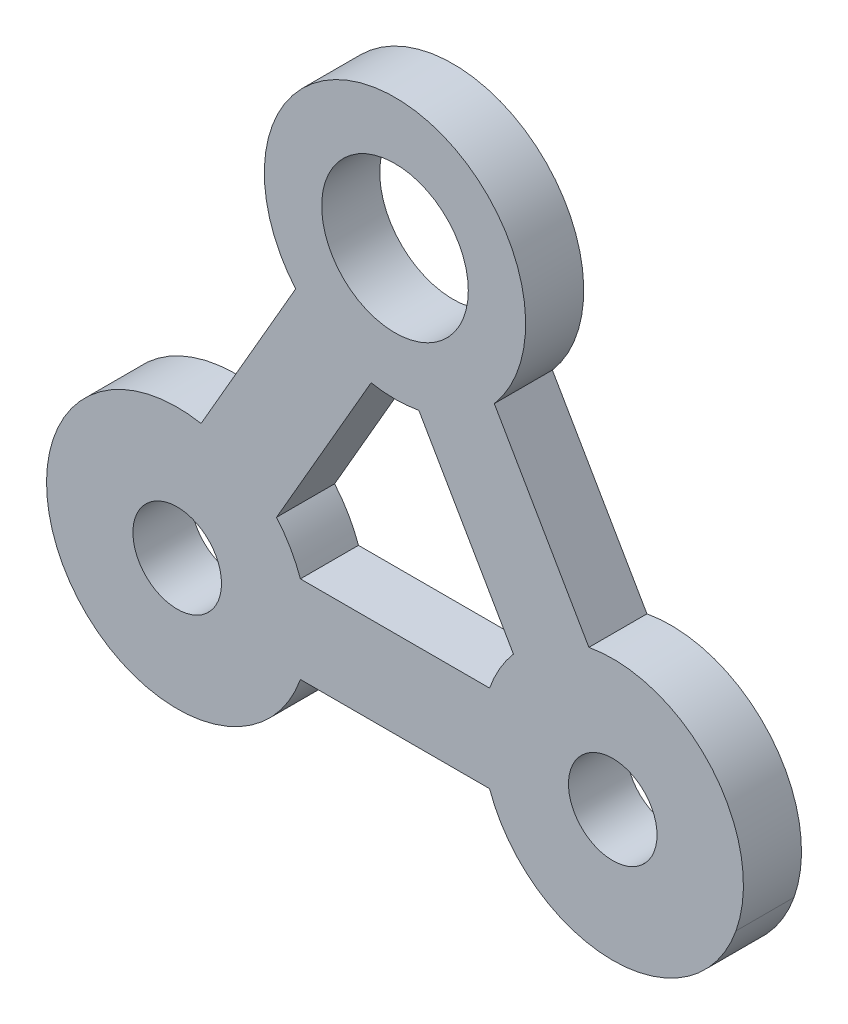
ISO-10303-21;
HEADER;
FILE_DESCRIPTION(('STEP AP214'),'2;1');
FILE_NAME('part.step','',(''),(''),'','','');
FILE_SCHEMA(('AUTOMOTIVE_DESIGN { 1 0 10303 214 1 1 1 1 }'));
ENDSEC;
DATA;
#1=APPLICATION_CONTEXT('core data for automotive mechanical design processes');
#2=APPLICATION_PROTOCOL_DEFINITION('international standard','automotive_design',2000,#1);
#3=PRODUCT_CONTEXT('',#1,'mechanical');
#4=PRODUCT('Part','Part','',(#3));
#5=PRODUCT_RELATED_PRODUCT_CATEGORY('part','',(#4));
#6=PRODUCT_DEFINITION_FORMATION('','',#4);
#7=PRODUCT_DEFINITION_CONTEXT('part definition',#1,'design');
#8=PRODUCT_DEFINITION('design','',#6,#7);
#9=PRODUCT_DEFINITION_SHAPE('','',#8);
#10=(LENGTH_UNIT() NAMED_UNIT(*) SI_UNIT(.MILLI.,.METRE.));
#11=(NAMED_UNIT(*) PLANE_ANGLE_UNIT() SI_UNIT($,.RADIAN.));
#12=(NAMED_UNIT(*) SI_UNIT($,.STERADIAN.) SOLID_ANGLE_UNIT());
#13=UNCERTAINTY_MEASURE_WITH_UNIT(LENGTH_MEASURE(1.E-05),#10,'distance_accuracy_value','');
#14=(GEOMETRIC_REPRESENTATION_CONTEXT(3) GLOBAL_UNCERTAINTY_ASSIGNED_CONTEXT((#13)) GLOBAL_UNIT_ASSIGNED_CONTEXT((#10,
#11,#12)) REPRESENTATION_CONTEXT('',''));
#15=CARTESIAN_POINT('',(0.,0.,0.));
#16=DIRECTION('',(0.,0.,1.));
#17=DIRECTION('',(1.,0.,0.));
#18=AXIS2_PLACEMENT_3D('',#15,#16,#17);
#19=CARTESIAN_POINT('',(10.0690039999383,-30.7922345044947,4.));
#20=DIRECTION('',(0.,0.,1.));
#21=DIRECTION('',(1.,0.,0.));
#22=AXIS2_PLACEMENT_3D('',#19,#20,#21);
#23=PLANE('',#22);
#24=CARTESIAN_POINT('',(-4.93094233155493,-4.81141433276065,4.));
#25=DIRECTION('',(0.,0.,1.));
#26=DIRECTION('',(1.,0.,0.));
#27=AXIS2_PLACEMENT_3D('',#24,#25,#26);
#28=CIRCLE('',#27,5.05);
#29=CARTESIAN_POINT('',(0.119057668445069,-4.81141433276065,4.));
#30=VERTEX_POINT('',#29);
#31=EDGE_CURVE('E582',#30,#30,#28,.T.);
#32=ORIENTED_EDGE('',*,*,#31,.F.);
#33=EDGE_LOOP('',(#32));
#34=FACE_BOUND('',#33,.T.);
#35=DIRECTION('',(-0.500000694027765,-0.866025003086951,0.));
#36=VECTOR('',#35,1.);
#37=CARTESIAN_POINT('',(-13.0902623878487,-24.9437367418577,4.));
#38=LINE('',#37,#36);
#39=CARTESIAN_POINT('',(-6.57551389843423,-13.6598822431626,4.));
#40=VERTEX_POINT('',#39);
#41=CARTESIAN_POINT('',(-13.0902623878487,-24.9437367418577,4.));
#42=VERTEX_POINT('',#41);
#43=EDGE_CURVE('E172',#40,#42,#38,.T.);
#44=ORIENTED_EDGE('',*,*,#43,.F.);
#45=CARTESIAN_POINT('',(-4.93094233155493,-4.81141433276065,4.));
#46=DIRECTION('',(0.,0.,-1.));
#47=DIRECTION('',(1.,0.,0.));
#48=AXIS2_PLACEMENT_3D('',#45,#46,#47);
#49=CIRCLE('',#48,9.);
#50=CARTESIAN_POINT('',(-3.28643861537157,-13.6598948535879,4.));
#51=VERTEX_POINT('',#50);
#52=EDGE_CURVE('E164',#51,#40,#49,.T.);
#53=ORIENTED_EDGE('',*,*,#52,.F.);
#54=DIRECTION('',(-0.499999305971914,0.86602580448137,0.));
#55=VECTOR('',#54,1.);
#56=CARTESIAN_POINT('',(-3.28643861537157,-13.6598948535879,4.));
#57=LINE('',#56,#55);
#58=CARTESIAN_POINT('',(3.2282917883985,-24.9437597940347,4.));
#59=VERTEX_POINT('',#58);
#60=EDGE_CURVE('E195',#59,#51,#57,.T.);
#61=ORIENTED_EDGE('',*,*,#60,.F.);
#62=CARTESIAN_POINT('',(10.0690039999383,-30.7922345044947,4.));
#63=DIRECTION('',(0.,0.,-1.));
#64=DIRECTION('',(1.,0.,0.));
#65=AXIS2_PLACEMENT_3D('',#62,#63,#64);
#66=CIRCLE('',#65,9.);
#67=CARTESIAN_POINT('',(1.58374322591848,-27.7921762389138,4.));
#68=VERTEX_POINT('',#67);
#69=EDGE_CURVE('E193',#68,#59,#66,.T.);
#70=ORIENTED_EDGE('',*,*,#69,.F.);
#71=DIRECTION('',(0.999999999999679,-8.01394419053135E-07,0.));
#72=VECTOR('',#71,1.);
#73=CARTESIAN_POINT('',(1.58374322591848,-27.7921762389138,4.));
#74=LINE('',#73,#72);
#75=CARTESIAN_POINT('',(-11.4457356672661,-27.7921657971621,4.));
#76=VERTEX_POINT('',#75);
#77=EDGE_CURVE('E188',#76,#68,#74,.T.);
#78=ORIENTED_EDGE('',*,*,#77,.F.);
#79=CARTESIAN_POINT('',(-19.9310194456852,-30.792158997104,4.));
#80=DIRECTION('',(0.,0.,-1.));
#81=DIRECTION('',(1.,0.,0.));
#82=AXIS2_PLACEMENT_3D('',#79,#80,#81);
#83=CIRCLE('',#82,9.00000000000001);
#84=EDGE_CURVE('E186',#42,#76,#83,.T.);
#85=ORIENTED_EDGE('',*,*,#84,.F.);
#86=EDGE_LOOP('',(#44,#53,#61,#70,#78,#85));
#87=FACE_BOUND('',#86,.T.);
#88=CARTESIAN_POINT('',(10.0690039999383,-30.7922345044947,4.));
#89=DIRECTION('',(0.,0.,1.));
#90=DIRECTION('',(1.,0.,0.));
#91=AXIS2_PLACEMENT_3D('',#88,#89,#90);
#92=CIRCLE('',#91,9.00000000000001);
#93=CARTESIAN_POINT('',(18.5542758795681,-33.7922613591684,4.));
#94=VERTEX_POINT('',#93);
#95=CARTESIAN_POINT('',(8.42444661528672,-21.9437639582032,4.));
#96=VERTEX_POINT('',#95);
#97=EDGE_CURVE('E220',#94,#96,#92,.T.);
#98=ORIENTED_EDGE('',*,*,#97,.T.);
#99=DIRECTION('',(-0.499999305971914,0.86602580448137,0.));
#100=VECTOR('',#99,1.);
#101=CARTESIAN_POINT('',(8.42444661528672,-21.9437639582032,4.));
#102=LINE('',#101,#100);
#103=CARTESIAN_POINT('',(1.90973440730732,-10.6599305338487,4.));
#104=VERTEX_POINT('',#103);
#105=EDGE_CURVE('E224',#96,#104,#102,.T.);
#106=ORIENTED_EDGE('',*,*,#105,.T.);
#107=CARTESIAN_POINT('',(-4.93094233155493,-4.81141433276065,4.));
#108=DIRECTION('',(0.,0.,1.));
#109=DIRECTION('',(1.,0.,0.));
#110=AXIS2_PLACEMENT_3D('',#107,#108,#109);
#111=CIRCLE('',#110,9.);
#112=CARTESIAN_POINT('',(-11.7716639169559,-10.659878078996,4.));
#113=VERTEX_POINT('',#112);
#114=EDGE_CURVE('E228',#104,#113,#111,.T.);
#115=ORIENTED_EDGE('',*,*,#114,.T.);
#116=DIRECTION('',(-0.500000694027764,-0.866025003086951,0.));
#117=VECTOR('',#116,1.);
#118=CARTESIAN_POINT('',(-11.7716639169559,-10.659878078996,4.));
#119=LINE('',#118,#117);
#120=CARTESIAN_POINT('',(-18.2863942105292,-21.943701061628,4.));
#121=VERTEX_POINT('',#120);
#122=EDGE_CURVE('E231',#113,#121,#119,.T.);
#123=ORIENTED_EDGE('',*,*,#122,.T.);
#124=CARTESIAN_POINT('',(-19.9310194456852,-30.792158997104,4.));
#125=DIRECTION('',(0.,0.,1.));
#126=DIRECTION('',(1.,0.,0.));
#127=AXIS2_PLACEMENT_3D('',#124,#125,#126);
#128=CIRCLE('',#127,9.00000000000001);
#129=CARTESIAN_POINT('',(-27.7099816604268,-26.2658197630627,4.));
#130=VERTEX_POINT('',#129);
#131=EDGE_CURVE('E234',#121,#130,#128,.T.);
#132=ORIENTED_EDGE('',*,*,#131,.T.);
#133=DIRECTION('',(-0.500000694027499,-0.866025003087104,0.));
#134=VECTOR('',#133,1.);
#135=CARTESIAN_POINT('',(-27.7099816604268,-26.2658197630627,4.));
#136=LINE('',#135,#134);
#137=CARTESIAN_POINT('',(-27.7252090010324,-26.2921942418434,4.));
#138=VERTEX_POINT('',#137);
#139=EDGE_CURVE('E236',#130,#138,#136,.T.);
#140=ORIENTED_EDGE('',*,*,#139,.T.);
#141=CARTESIAN_POINT('',(-19.9309839732497,-30.792200488093,4.));
#142=DIRECTION('',(0.,0.,1.));
#143=DIRECTION('',(1.,0.,0.));
#144=AXIS2_PLACEMENT_3D('',#141,#142,#143);
#145=CIRCLE('',#144,9.);
#146=CARTESIAN_POINT('',(-26.7717410302534,-36.6406227443135,4.));
#147=VERTEX_POINT('',#146);
#148=EDGE_CURVE('E238',#138,#147,#145,.T.);
#149=ORIENTED_EDGE('',*,*,#148,.T.);
#150=CARTESIAN_POINT('',(-19.9310194456852,-30.792158997104,4.));
#151=DIRECTION('',(0.,0.,1.));
#152=DIRECTION('',(1.,0.,0.));
#153=AXIS2_PLACEMENT_3D('',#150,#151,#152);
#154=CIRCLE('',#153,9.00000000000001);
#155=CARTESIAN_POINT('',(-11.4457404756326,-33.7921657971602,4.));
#156=VERTEX_POINT('',#155);
#157=EDGE_CURVE('E241',#147,#156,#154,.T.);
#158=ORIENTED_EDGE('',*,*,#157,.T.);
#159=DIRECTION('',(0.999999999999679,-8.01394418245061E-07,0.));
#160=VECTOR('',#159,1.);
#161=CARTESIAN_POINT('',(-11.4457404756326,-33.7921657971602,4.));
#162=LINE('',#161,#160);
#163=CARTESIAN_POINT('',(1.58370202592011,-33.7921762388827,4.));
#164=VERTEX_POINT('',#163);
#165=EDGE_CURVE('E243',#156,#164,#162,.T.);
#166=ORIENTED_EDGE('',*,*,#165,.T.);
#167=CARTESIAN_POINT('',(10.0690039999383,-30.7922345044947,4.));
#168=DIRECTION('',(0.,0.,1.));
#169=DIRECTION('',(1.,0.,0.));
#170=AXIS2_PLACEMENT_3D('',#167,#168,#169);
#171=CIRCLE('',#170,9.00000000000001);
#172=CARTESIAN_POINT('',(10.0442594232947,-39.792200488093,4.));
#173=VERTEX_POINT('',#172);
#174=EDGE_CURVE('E245',#164,#173,#171,.T.);
#175=ORIENTED_EDGE('',*,*,#174,.T.);
#176=DIRECTION('',(1.,2.80284567968024E-13,0.));
#177=VECTOR('',#176,1.);
#178=CARTESIAN_POINT('',(10.0442594232947,-39.792200488093,4.));
#179=LINE('',#178,#177);
#180=CARTESIAN_POINT('',(10.0690160267503,-39.792200488093,4.));
#181=VERTEX_POINT('',#180);
#182=EDGE_CURVE('E247',#173,#181,#179,.T.);
#183=ORIENTED_EDGE('',*,*,#182,.T.);
#184=CARTESIAN_POINT('',(10.0690160267503,-30.792200488093,4.));
#185=DIRECTION('',(0.,0.,1.));
#186=DIRECTION('',(1.,0.,0.));
#187=AXIS2_PLACEMENT_3D('',#184,#185,#186);
#188=CIRCLE('',#187,9.00000000000001);
#189=EDGE_CURVE('E249',#181,#94,#188,.T.);
#190=ORIENTED_EDGE('',*,*,#189,.T.);
#191=EDGE_LOOP('',(#98,#106,#115,#123,#132,#140,#149,#158,#166,#175,#183,#190));
#192=FACE_BOUND('',#191,.T.);
#193=CARTESIAN_POINT('',(10.0690160267503,-30.792200488093,4.));
#194=DIRECTION('',(0.,0.,1.));
#195=DIRECTION('',(1.,0.,0.));
#196=AXIS2_PLACEMENT_3D('',#193,#194,#195);
#197=CIRCLE('',#196,3.05);
#198=CARTESIAN_POINT('',(13.1190160267503,-30.792200488093,4.));
#199=VERTEX_POINT('',#198);
#200=EDGE_CURVE('E199',#199,#199,#197,.T.);
#201=ORIENTED_EDGE('',*,*,#200,.F.);
#202=EDGE_LOOP('',(#201));
#203=FACE_BOUND('',#202,.T.);
#204=CARTESIAN_POINT('',(-19.9309839732497,-30.792200488093,4.));
#205=DIRECTION('',(0.,0.,1.));
#206=DIRECTION('',(1.,0.,0.));
#207=AXIS2_PLACEMENT_3D('',#204,#205,#206);
#208=CIRCLE('',#207,3.05);
#209=CARTESIAN_POINT('',(-16.8809839732497,-30.792200488093,4.));
#210=VERTEX_POINT('',#209);
#211=EDGE_CURVE('E596',#210,#210,#208,.T.);
#212=ORIENTED_EDGE('',*,*,#211,.F.);
#213=EDGE_LOOP('',(#212));
#214=FACE_BOUND('',#213,.T.);
#215=ADVANCED_FACE('F39',(#34,#87,#192,#203,#214),#23,.T.);
#216=CARTESIAN_POINT('',(10.0690039999383,-30.7922345044947,0.));
#217=DIRECTION('',(0.,0.,1.));
#218=DIRECTION('',(1.,0.,0.));
#219=AXIS2_PLACEMENT_3D('',#216,#217,#218);
#220=PLANE('',#219);
#221=CARTESIAN_POINT('',(10.0690039999383,-30.7922345044947,0.));
#222=DIRECTION('',(0.,0.,1.));
#223=DIRECTION('',(1.,0.,0.));
#224=AXIS2_PLACEMENT_3D('',#221,#222,#223);
#225=CIRCLE('',#224,9.00000000000001);
#226=CARTESIAN_POINT('',(18.5542758795681,-33.7922613591684,0.));
#227=VERTEX_POINT('',#226);
#228=CARTESIAN_POINT('',(8.42444661528672,-21.9437639582032,0.));
#229=VERTEX_POINT('',#228);
#230=EDGE_CURVE('E180',#227,#229,#225,.T.);
#231=ORIENTED_EDGE('',*,*,#230,.F.);
#232=CARTESIAN_POINT('',(10.0690160267503,-30.792200488093,0.));
#233=DIRECTION('',(0.,0.,1.));
#234=DIRECTION('',(1.,0.,0.));
#235=AXIS2_PLACEMENT_3D('',#232,#233,#234);
#236=CIRCLE('',#235,9.00000000000001);
#237=CARTESIAN_POINT('',(10.0690160267503,-39.792200488093,0.));
#238=VERTEX_POINT('',#237);
#239=EDGE_CURVE('E225',#238,#227,#236,.T.);
#240=ORIENTED_EDGE('',*,*,#239,.F.);
#241=DIRECTION('',(1.,2.80284567968024E-13,0.));
#242=VECTOR('',#241,1.);
#243=CARTESIAN_POINT('',(10.0442594232947,-39.792200488093,0.));
#244=LINE('',#243,#242);
#245=CARTESIAN_POINT('',(10.0442594232947,-39.792200488093,0.));
#246=VERTEX_POINT('',#245);
#247=EDGE_CURVE('E278',#246,#238,#244,.T.);
#248=ORIENTED_EDGE('',*,*,#247,.F.);
#249=CARTESIAN_POINT('',(10.0690039999383,-30.7922345044947,0.));
#250=DIRECTION('',(0.,0.,1.));
#251=DIRECTION('',(1.,0.,0.));
#252=AXIS2_PLACEMENT_3D('',#249,#250,#251);
#253=CIRCLE('',#252,9.00000000000001);
#254=CARTESIAN_POINT('',(1.58370202592011,-33.7921762388827,0.));
#255=VERTEX_POINT('',#254);
#256=EDGE_CURVE('E276',#255,#246,#253,.T.);
#257=ORIENTED_EDGE('',*,*,#256,.F.);
#258=DIRECTION('',(0.999999999999679,-8.01394418245061E-07,0.));
#259=VECTOR('',#258,1.);
#260=CARTESIAN_POINT('',(-11.4457404756326,-33.7921657971602,0.));
#261=LINE('',#260,#259);
#262=CARTESIAN_POINT('',(-11.4457404756326,-33.7921657971602,0.));
#263=VERTEX_POINT('',#262);
#264=EDGE_CURVE('E273',#263,#255,#261,.T.);
#265=ORIENTED_EDGE('',*,*,#264,.F.);
#266=CARTESIAN_POINT('',(-19.9310194456852,-30.792158997104,0.));
#267=DIRECTION('',(0.,0.,1.));
#268=DIRECTION('',(1.,0.,0.));
#269=AXIS2_PLACEMENT_3D('',#266,#267,#268);
#270=CIRCLE('',#269,9.00000000000001);
#271=CARTESIAN_POINT('',(-26.7717410302534,-36.6406227443135,0.));
#272=VERTEX_POINT('',#271);
#273=EDGE_CURVE('E270',#272,#263,#270,.T.);
#274=ORIENTED_EDGE('',*,*,#273,.F.);
#275=CARTESIAN_POINT('',(-19.9309839732497,-30.792200488093,0.));
#276=DIRECTION('',(0.,0.,1.));
#277=DIRECTION('',(1.,0.,0.));
#278=AXIS2_PLACEMENT_3D('',#275,#276,#277);
#279=CIRCLE('',#278,9.);
#280=CARTESIAN_POINT('',(-27.7252090010324,-26.2921942418434,0.));
#281=VERTEX_POINT('',#280);
#282=EDGE_CURVE('E267',#281,#272,#279,.T.);
#283=ORIENTED_EDGE('',*,*,#282,.F.);
#284=DIRECTION('',(-0.500000694027499,-0.866025003087104,0.));
#285=VECTOR('',#284,1.);
#286=CARTESIAN_POINT('',(-27.7099816604268,-26.2658197630627,0.));
#287=LINE('',#286,#285);
#288=CARTESIAN_POINT('',(-27.7099816604268,-26.2658197630627,0.));
#289=VERTEX_POINT('',#288);
#290=EDGE_CURVE('E265',#289,#281,#287,.T.);
#291=ORIENTED_EDGE('',*,*,#290,.F.);
#292=CARTESIAN_POINT('',(-19.9310194456852,-30.792158997104,0.));
#293=DIRECTION('',(0.,0.,1.));
#294=DIRECTION('',(1.,0.,0.));
#295=AXIS2_PLACEMENT_3D('',#292,#293,#294);
#296=CIRCLE('',#295,9.00000000000001);
#297=CARTESIAN_POINT('',(-18.2863942105292,-21.943701061628,0.));
#298=VERTEX_POINT('',#297);
#299=EDGE_CURVE('E262',#298,#289,#296,.T.);
#300=ORIENTED_EDGE('',*,*,#299,.F.);
#301=DIRECTION('',(-0.500000694027764,-0.866025003086951,0.));
#302=VECTOR('',#301,1.);
#303=CARTESIAN_POINT('',(-11.7716639169559,-10.659878078996,0.));
#304=LINE('',#303,#302);
#305=CARTESIAN_POINT('',(-11.7716639169559,-10.659878078996,0.));
#306=VERTEX_POINT('',#305);
#307=EDGE_CURVE('E260',#306,#298,#304,.T.);
#308=ORIENTED_EDGE('',*,*,#307,.F.);
#309=CARTESIAN_POINT('',(-4.93094233155493,-4.81141433276065,0.));
#310=DIRECTION('',(0.,0.,1.));
#311=DIRECTION('',(1.,0.,0.));
#312=AXIS2_PLACEMENT_3D('',#309,#310,#311);
#313=CIRCLE('',#312,9.);
#314=CARTESIAN_POINT('',(1.90973440730732,-10.6599305338487,0.));
#315=VERTEX_POINT('',#314);
#316=EDGE_CURVE('E258',#315,#306,#313,.T.);
#317=ORIENTED_EDGE('',*,*,#316,.F.);
#318=DIRECTION('',(-0.499999305971914,0.86602580448137,0.));
#319=VECTOR('',#318,1.);
#320=CARTESIAN_POINT('',(8.42444661528672,-21.9437639582032,0.));
#321=LINE('',#320,#319);
#322=EDGE_CURVE('E255',#229,#315,#321,.T.);
#323=ORIENTED_EDGE('',*,*,#322,.F.);
#324=EDGE_LOOP('',(#231,#240,#248,#257,#265,#274,#283,#291,#300,#308,#317,#323));
#325=FACE_BOUND('',#324,.T.);
#326=CARTESIAN_POINT('',(-4.93094233155493,-4.81141433276065,0.));
#327=DIRECTION('',(0.,0.,-1.));
#328=DIRECTION('',(1.,0.,0.));
#329=AXIS2_PLACEMENT_3D('',#326,#327,#328);
#330=CIRCLE('',#329,9.);
#331=CARTESIAN_POINT('',(-3.28643861537157,-13.6598948535879,0.));
#332=VERTEX_POINT('',#331);
#333=CARTESIAN_POINT('',(-6.57551389843423,-13.6598822431626,0.));
#334=VERTEX_POINT('',#333);
#335=EDGE_CURVE('E62',#332,#334,#330,.T.);
#336=ORIENTED_EDGE('',*,*,#335,.T.);
#337=DIRECTION('',(-0.500000694027765,-0.866025003086951,0.));
#338=VECTOR('',#337,1.);
#339=CARTESIAN_POINT('',(-13.0902623878487,-24.9437367418577,0.));
#340=LINE('',#339,#338);
#341=CARTESIAN_POINT('',(-13.0902623878487,-24.9437367418577,0.));
#342=VERTEX_POINT('',#341);
#343=EDGE_CURVE('E179',#334,#342,#340,.T.);
#344=ORIENTED_EDGE('',*,*,#343,.T.);
#345=CARTESIAN_POINT('',(-19.9310194456852,-30.792158997104,0.));
#346=DIRECTION('',(0.,0.,-1.));
#347=DIRECTION('',(1.,0.,0.));
#348=AXIS2_PLACEMENT_3D('',#345,#346,#347);
#349=CIRCLE('',#348,9.00000000000001);
#350=CARTESIAN_POINT('',(-11.4457356672661,-27.7921657971621,0.));
#351=VERTEX_POINT('',#350);
#352=EDGE_CURVE('E201',#342,#351,#349,.T.);
#353=ORIENTED_EDGE('',*,*,#352,.T.);
#354=DIRECTION('',(0.999999999999679,-8.01394419053135E-07,0.));
#355=VECTOR('',#354,1.);
#356=CARTESIAN_POINT('',(1.58374322591848,-27.7921762389138,0.));
#357=LINE('',#356,#355);
#358=CARTESIAN_POINT('',(1.58374322591848,-27.7921762389138,0.));
#359=VERTEX_POINT('',#358);
#360=EDGE_CURVE('E204',#351,#359,#357,.T.);
#361=ORIENTED_EDGE('',*,*,#360,.T.);
#362=CARTESIAN_POINT('',(10.0690039999383,-30.7922345044947,0.));
#363=DIRECTION('',(0.,0.,-1.));
#364=DIRECTION('',(1.,0.,0.));
#365=AXIS2_PLACEMENT_3D('',#362,#363,#364);
#366=CIRCLE('',#365,9.);
#367=CARTESIAN_POINT('',(3.2282917883985,-24.9437597940347,0.));
#368=VERTEX_POINT('',#367);
#369=EDGE_CURVE('E207',#359,#368,#366,.T.);
#370=ORIENTED_EDGE('',*,*,#369,.T.);
#371=DIRECTION('',(-0.499999305971914,0.86602580448137,0.));
#372=VECTOR('',#371,1.);
#373=CARTESIAN_POINT('',(-3.28643861537157,-13.6598948535879,0.));
#374=LINE('',#373,#372);
#375=EDGE_CURVE('E173',#368,#332,#374,.T.);
#376=ORIENTED_EDGE('',*,*,#375,.T.);
#377=EDGE_LOOP('',(#336,#344,#353,#361,#370,#376));
#378=FACE_BOUND('',#377,.T.);
#379=CARTESIAN_POINT('',(10.0690160267503,-30.792200488093,0.));
#380=DIRECTION('',(0.,0.,1.));
#381=DIRECTION('',(1.,0.,0.));
#382=AXIS2_PLACEMENT_3D('',#379,#380,#381);
#383=CIRCLE('',#382,3.05);
#384=CARTESIAN_POINT('',(13.1190160267503,-30.792200488093,0.));
#385=VERTEX_POINT('',#384);
#386=EDGE_CURVE('E579',#385,#385,#383,.T.);
#387=ORIENTED_EDGE('',*,*,#386,.T.);
#388=EDGE_LOOP('',(#387));
#389=FACE_BOUND('',#388,.T.);
#390=CARTESIAN_POINT('',(-4.93094233155493,-4.81141433276065,0.));
#391=DIRECTION('',(0.,0.,1.));
#392=DIRECTION('',(1.,0.,0.));
#393=AXIS2_PLACEMENT_3D('',#390,#391,#392);
#394=CIRCLE('',#393,5.05);
#395=CARTESIAN_POINT('',(0.119057668445069,-4.81141433276065,0.));
#396=VERTEX_POINT('',#395);
#397=EDGE_CURVE('E592',#396,#396,#394,.T.);
#398=ORIENTED_EDGE('',*,*,#397,.T.);
#399=EDGE_LOOP('',(#398));
#400=FACE_BOUND('',#399,.T.);
#401=CARTESIAN_POINT('',(-19.9309839732497,-30.792200488093,0.));
#402=DIRECTION('',(0.,0.,1.));
#403=DIRECTION('',(1.,0.,0.));
#404=AXIS2_PLACEMENT_3D('',#401,#402,#403);
#405=CIRCLE('',#404,3.05);
#406=CARTESIAN_POINT('',(-16.8809839732497,-30.792200488093,0.));
#407=VERTEX_POINT('',#406);
#408=EDGE_CURVE('E598',#407,#407,#405,.T.);
#409=ORIENTED_EDGE('',*,*,#408,.T.);
#410=EDGE_LOOP('',(#409));
#411=FACE_BOUND('',#410,.T.);
#412=ADVANCED_FACE('F322',(#325,#378,#389,#400,#411),#220,.F.);
#413=CARTESIAN_POINT('',(10.0690039999383,-30.7922345044947,4.));
#414=DIRECTION('',(0.,0.,-1.));
#415=DIRECTION('',(-1.,0.,0.));
#416=AXIS2_PLACEMENT_3D('',#413,#414,#415);
#417=CYLINDRICAL_SURFACE('',#416,9.00000000000001);
#418=ORIENTED_EDGE('',*,*,#230,.T.);
#419=DIRECTION('',(0.,0.,-1.));
#420=VECTOR('',#419,1.);
#421=CARTESIAN_POINT('',(8.42444661528672,-21.9437639582032,4.));
#422=LINE('',#421,#420);
#423=EDGE_CURVE('E11',#96,#229,#422,.T.);
#424=ORIENTED_EDGE('',*,*,#423,.F.);
#425=ORIENTED_EDGE('',*,*,#97,.F.);
#426=DIRECTION('',(0.,0.,-1.));
#427=VECTOR('',#426,1.);
#428=CARTESIAN_POINT('',(18.5542758795681,-33.7922613591684,4.));
#429=LINE('',#428,#427);
#430=EDGE_CURVE('E251',#94,#227,#429,.T.);
#431=ORIENTED_EDGE('',*,*,#430,.T.);
#432=EDGE_LOOP('',(#418,#424,#425,#431));
#433=FACE_BOUND('',#432,.T.);
#434=ADVANCED_FACE('F41',(#433),#417,.T.);
#435=CARTESIAN_POINT('',(8.42444661528672,-21.9437639582032,4.));
#436=DIRECTION('',(-0.86602580448137,-0.499999305971914,0.));
#437=DIRECTION('',(0.499999305971914,-0.86602580448137,0.));
#438=AXIS2_PLACEMENT_3D('',#435,#436,#437);
#439=PLANE('',#438);
#440=ORIENTED_EDGE('',*,*,#322,.T.);
#441=DIRECTION('',(0.,0.,-1.));
#442=VECTOR('',#441,1.);
#443=CARTESIAN_POINT('',(1.90973440730732,-10.6599305338487,4.));
#444=LINE('',#443,#442);
#445=EDGE_CURVE('E47',#104,#315,#444,.T.);
#446=ORIENTED_EDGE('',*,*,#445,.F.);
#447=ORIENTED_EDGE('',*,*,#105,.F.);
#448=ORIENTED_EDGE('',*,*,#423,.T.);
#449=EDGE_LOOP('',(#440,#446,#447,#448));
#450=FACE_BOUND('',#449,.T.);
#451=ADVANCED_FACE('F339',(#450),#439,.F.);
#452=CARTESIAN_POINT('',(-4.93094233155493,-4.81141433276065,4.));
#453=DIRECTION('',(0.,0.,-1.));
#454=DIRECTION('',(-1.,0.,0.));
#455=AXIS2_PLACEMENT_3D('',#452,#453,#454);
#456=CYLINDRICAL_SURFACE('',#455,9.);
#457=ORIENTED_EDGE('',*,*,#316,.T.);
#458=DIRECTION('',(0.,0.,-1.));
#459=VECTOR('',#458,1.);
#460=CARTESIAN_POINT('',(-11.7716639169559,-10.659878078996,4.));
#461=LINE('',#460,#459);
#462=EDGE_CURVE('E309',#113,#306,#461,.T.);
#463=ORIENTED_EDGE('',*,*,#462,.F.);
#464=ORIENTED_EDGE('',*,*,#114,.F.);
#465=ORIENTED_EDGE('',*,*,#445,.T.);
#466=EDGE_LOOP('',(#457,#463,#464,#465));
#467=FACE_BOUND('',#466,.T.);
#468=ADVANCED_FACE('F316',(#467),#456,.T.);
#469=CARTESIAN_POINT('',(-11.7716639169559,-10.659878078996,4.));
#470=DIRECTION('',(0.866025003086951,-0.500000694027764,0.));
#471=DIRECTION('',(0.500000694027764,0.866025003086951,0.));
#472=AXIS2_PLACEMENT_3D('',#469,#470,#471);
#473=PLANE('',#472);
#474=ORIENTED_EDGE('',*,*,#307,.T.);
#475=DIRECTION('',(0.,0.,-1.));
#476=VECTOR('',#475,1.);
#477=CARTESIAN_POINT('',(-18.2863942105292,-21.943701061628,4.));
#478=LINE('',#477,#476);
#479=EDGE_CURVE('E306',#121,#298,#478,.T.);
#480=ORIENTED_EDGE('',*,*,#479,.F.);
#481=ORIENTED_EDGE('',*,*,#122,.F.);
#482=ORIENTED_EDGE('',*,*,#462,.T.);
#483=EDGE_LOOP('',(#474,#480,#481,#482));
#484=FACE_BOUND('',#483,.T.);
#485=ADVANCED_FACE('F328',(#484),#473,.F.);
#486=CARTESIAN_POINT('',(-19.9310194456852,-30.792158997104,4.));
#487=DIRECTION('',(0.,0.,-1.));
#488=DIRECTION('',(-1.,0.,0.));
#489=AXIS2_PLACEMENT_3D('',#486,#487,#488);
#490=CYLINDRICAL_SURFACE('',#489,9.00000000000001);
#491=ORIENTED_EDGE('',*,*,#299,.T.);
#492=DIRECTION('',(0.,0.,-1.));
#493=VECTOR('',#492,1.);
#494=CARTESIAN_POINT('',(-27.7099816604268,-26.2658197630627,4.));
#495=LINE('',#494,#493);
#496=EDGE_CURVE('E303',#130,#289,#495,.T.);
#497=ORIENTED_EDGE('',*,*,#496,.F.);
#498=ORIENTED_EDGE('',*,*,#131,.F.);
#499=ORIENTED_EDGE('',*,*,#479,.T.);
#500=EDGE_LOOP('',(#491,#497,#498,#499));
#501=FACE_BOUND('',#500,.T.);
#502=ADVANCED_FACE('F332',(#501),#490,.T.);
#503=CARTESIAN_POINT('',(-27.7099816604268,-26.2658197630627,4.));
#504=DIRECTION('',(0.866025003087104,-0.500000694027499,0.));
#505=DIRECTION('',(0.500000694027499,0.866025003087104,0.));
#506=AXIS2_PLACEMENT_3D('',#503,#504,#505);
#507=PLANE('',#506);
#508=ORIENTED_EDGE('',*,*,#290,.T.);
#509=DIRECTION('',(0.,0.,-1.));
#510=VECTOR('',#509,1.);
#511=CARTESIAN_POINT('',(-27.7252090010324,-26.2921942418434,4.));
#512=LINE('',#511,#510);
#513=EDGE_CURVE('E300',#138,#281,#512,.T.);
#514=ORIENTED_EDGE('',*,*,#513,.F.);
#515=ORIENTED_EDGE('',*,*,#139,.F.);
#516=ORIENTED_EDGE('',*,*,#496,.T.);
#517=EDGE_LOOP('',(#508,#514,#515,#516));
#518=FACE_BOUND('',#517,.T.);
#519=ADVANCED_FACE('F372',(#518),#507,.F.);
#520=CARTESIAN_POINT('',(-19.9309839732497,-30.792200488093,4.));
#521=DIRECTION('',(0.,0.,-1.));
#522=DIRECTION('',(-1.,0.,0.));
#523=AXIS2_PLACEMENT_3D('',#520,#521,#522);
#524=CYLINDRICAL_SURFACE('',#523,9.);
#525=ORIENTED_EDGE('',*,*,#282,.T.);
#526=DIRECTION('',(0.,0.,-1.));
#527=VECTOR('',#526,1.);
#528=CARTESIAN_POINT('',(-26.7717410302534,-36.6406227443135,4.));
#529=LINE('',#528,#527);
#530=EDGE_CURVE('E297',#147,#272,#529,.T.);
#531=ORIENTED_EDGE('',*,*,#530,.F.);
#532=ORIENTED_EDGE('',*,*,#148,.F.);
#533=ORIENTED_EDGE('',*,*,#513,.T.);
#534=EDGE_LOOP('',(#525,#531,#532,#533));
#535=FACE_BOUND('',#534,.T.);
#536=ADVANCED_FACE('F370',(#535),#524,.T.);
#537=CARTESIAN_POINT('',(-19.9310194456852,-30.792158997104,4.));
#538=DIRECTION('',(0.,0.,-1.));
#539=DIRECTION('',(-1.,0.,0.));
#540=AXIS2_PLACEMENT_3D('',#537,#538,#539);
#541=CYLINDRICAL_SURFACE('',#540,9.00000000000001);
#542=ORIENTED_EDGE('',*,*,#273,.T.);
#543=DIRECTION('',(0.,0.,-1.));
#544=VECTOR('',#543,1.);
#545=CARTESIAN_POINT('',(-11.4457404756326,-33.7921657971602,4.));
#546=LINE('',#545,#544);
#547=EDGE_CURVE('E293',#156,#263,#546,.T.);
#548=ORIENTED_EDGE('',*,*,#547,.F.);
#549=ORIENTED_EDGE('',*,*,#157,.F.);
#550=ORIENTED_EDGE('',*,*,#530,.T.);
#551=EDGE_LOOP('',(#542,#548,#549,#550));
#552=FACE_BOUND('',#551,.T.);
#553=ADVANCED_FACE('F366',(#552),#541,.T.);
#554=CARTESIAN_POINT('',(-11.4457404756326,-33.7921657971602,4.));
#555=DIRECTION('',(8.01394418245061E-07,0.999999999999679,0.));
#556=DIRECTION('',(-0.999999999999679,8.01394418245061E-07,0.));
#557=AXIS2_PLACEMENT_3D('',#554,#555,#556);
#558=PLANE('',#557);
#559=ORIENTED_EDGE('',*,*,#264,.T.);
#560=DIRECTION('',(0.,0.,-1.));
#561=VECTOR('',#560,1.);
#562=CARTESIAN_POINT('',(1.58370202592011,-33.7921762388827,4.));
#563=LINE('',#562,#561);
#564=EDGE_CURVE('E290',#164,#255,#563,.T.);
#565=ORIENTED_EDGE('',*,*,#564,.F.);
#566=ORIENTED_EDGE('',*,*,#165,.F.);
#567=ORIENTED_EDGE('',*,*,#547,.T.);
#568=EDGE_LOOP('',(#559,#565,#566,#567));
#569=FACE_BOUND('',#568,.T.);
#570=ADVANCED_FACE('F361',(#569),#558,.F.);
#571=CARTESIAN_POINT('',(10.0690039999383,-30.7922345044947,4.));
#572=DIRECTION('',(0.,0.,-1.));
#573=DIRECTION('',(-1.,0.,0.));
#574=AXIS2_PLACEMENT_3D('',#571,#572,#573);
#575=CYLINDRICAL_SURFACE('',#574,9.00000000000001);
#576=ORIENTED_EDGE('',*,*,#256,.T.);
#577=DIRECTION('',(0.,0.,-1.));
#578=VECTOR('',#577,1.);
#579=CARTESIAN_POINT('',(10.0442594232947,-39.792200488093,4.));
#580=LINE('',#579,#578);
#581=EDGE_CURVE('E287',#173,#246,#580,.T.);
#582=ORIENTED_EDGE('',*,*,#581,.F.);
#583=ORIENTED_EDGE('',*,*,#174,.F.);
#584=ORIENTED_EDGE('',*,*,#564,.T.);
#585=EDGE_LOOP('',(#576,#582,#583,#584));
#586=FACE_BOUND('',#585,.T.);
#587=ADVANCED_FACE('F355',(#586),#575,.T.);
#588=CARTESIAN_POINT('',(10.0442594232947,-39.792200488093,4.));
#589=DIRECTION('',(-2.80284567968024E-13,1.,0.));
#590=DIRECTION('',(-1.,-2.80284567968024E-13,0.));
#591=AXIS2_PLACEMENT_3D('',#588,#589,#590);
#592=PLANE('',#591);
#593=ORIENTED_EDGE('',*,*,#247,.T.);
#594=DIRECTION('',(0.,0.,-1.));
#595=VECTOR('',#594,1.);
#596=CARTESIAN_POINT('',(10.0690160267503,-39.792200488093,4.));
#597=LINE('',#596,#595);
#598=EDGE_CURVE('E284',#181,#238,#597,.T.);
#599=ORIENTED_EDGE('',*,*,#598,.F.);
#600=ORIENTED_EDGE('',*,*,#182,.F.);
#601=ORIENTED_EDGE('',*,*,#581,.T.);
#602=EDGE_LOOP('',(#593,#599,#600,#601));
#603=FACE_BOUND('',#602,.T.);
#604=ADVANCED_FACE('F351',(#603),#592,.F.);
#605=CARTESIAN_POINT('',(10.0690160267503,-30.792200488093,4.));
#606=DIRECTION('',(0.,0.,-1.));
#607=DIRECTION('',(-1.,0.,0.));
#608=AXIS2_PLACEMENT_3D('',#605,#606,#607);
#609=CYLINDRICAL_SURFACE('',#608,9.00000000000001);
#610=ORIENTED_EDGE('',*,*,#239,.T.);
#611=ORIENTED_EDGE('',*,*,#430,.F.);
#612=ORIENTED_EDGE('',*,*,#189,.F.);
#613=ORIENTED_EDGE('',*,*,#598,.T.);
#614=EDGE_LOOP('',(#610,#611,#612,#613));
#615=FACE_BOUND('',#614,.T.);
#616=ADVANCED_FACE('F346',(#615),#609,.T.);
#617=CARTESIAN_POINT('',(-4.93094233155493,-4.81141433276065,4.));
#618=DIRECTION('',(0.,0.,-1.));
#619=DIRECTION('',(-1.,0.,0.));
#620=AXIS2_PLACEMENT_3D('',#617,#618,#619);
#621=CYLINDRICAL_SURFACE('',#620,9.);
#622=ORIENTED_EDGE('',*,*,#335,.F.);
#623=DIRECTION('',(0.,0.,-1.));
#624=VECTOR('',#623,1.);
#625=CARTESIAN_POINT('',(-3.28643861537157,-13.6598948535879,4.));
#626=LINE('',#625,#624);
#627=EDGE_CURVE('E168',#51,#332,#626,.T.);
#628=ORIENTED_EDGE('',*,*,#627,.F.);
#629=ORIENTED_EDGE('',*,*,#52,.T.);
#630=DIRECTION('',(0.,0.,-1.));
#631=VECTOR('',#630,1.);
#632=CARTESIAN_POINT('',(-6.57551389843423,-13.6598822431626,4.));
#633=LINE('',#632,#631);
#634=EDGE_CURVE('E167',#40,#334,#633,.T.);
#635=ORIENTED_EDGE('',*,*,#634,.T.);
#636=EDGE_LOOP('',(#622,#628,#629,#635));
#637=FACE_BOUND('',#636,.T.);
#638=ADVANCED_FACE('F166',(#637),#621,.T.);
#639=CARTESIAN_POINT('',(-13.0902623878487,-24.9437367418577,4.));
#640=DIRECTION('',(0.866025003086951,-0.500000694027765,0.));
#641=DIRECTION('',(0.500000694027765,0.866025003086951,0.));
#642=AXIS2_PLACEMENT_3D('',#639,#640,#641);
#643=PLANE('',#642);
#644=ORIENTED_EDGE('',*,*,#343,.F.);
#645=ORIENTED_EDGE('',*,*,#634,.F.);
#646=ORIENTED_EDGE('',*,*,#43,.T.);
#647=DIRECTION('',(0.,0.,-1.));
#648=VECTOR('',#647,1.);
#649=CARTESIAN_POINT('',(-13.0902623878487,-24.9437367418577,4.));
#650=LINE('',#649,#648);
#651=EDGE_CURVE('E181',#42,#342,#650,.T.);
#652=ORIENTED_EDGE('',*,*,#651,.T.);
#653=EDGE_LOOP('',(#644,#645,#646,#652));
#654=FACE_BOUND('',#653,.T.);
#655=ADVANCED_FACE('F176',(#654),#643,.T.);
#656=CARTESIAN_POINT('',(-19.9310194456852,-30.792158997104,4.));
#657=DIRECTION('',(0.,0.,-1.));
#658=DIRECTION('',(-1.,0.,0.));
#659=AXIS2_PLACEMENT_3D('',#656,#657,#658);
#660=CYLINDRICAL_SURFACE('',#659,9.00000000000001);
#661=ORIENTED_EDGE('',*,*,#352,.F.);
#662=ORIENTED_EDGE('',*,*,#651,.F.);
#663=ORIENTED_EDGE('',*,*,#84,.T.);
#664=DIRECTION('',(0.,0.,-1.));
#665=VECTOR('',#664,1.);
#666=CARTESIAN_POINT('',(-11.4457356672661,-27.7921657971621,4.));
#667=LINE('',#666,#665);
#668=EDGE_CURVE('E217',#76,#351,#667,.T.);
#669=ORIENTED_EDGE('',*,*,#668,.T.);
#670=EDGE_LOOP('',(#661,#662,#663,#669));
#671=FACE_BOUND('',#670,.T.);
#672=ADVANCED_FACE('F432',(#671),#660,.T.);
#673=CARTESIAN_POINT('',(1.58374322591848,-27.7921762389138,4.));
#674=DIRECTION('',(8.01394419053135E-07,0.999999999999679,0.));
#675=DIRECTION('',(-0.999999999999679,8.01394419053135E-07,0.));
#676=AXIS2_PLACEMENT_3D('',#673,#674,#675);
#677=PLANE('',#676);
#678=ORIENTED_EDGE('',*,*,#360,.F.);
#679=ORIENTED_EDGE('',*,*,#668,.F.);
#680=ORIENTED_EDGE('',*,*,#77,.T.);
#681=DIRECTION('',(0.,0.,-1.));
#682=VECTOR('',#681,1.);
#683=CARTESIAN_POINT('',(1.58374322591848,-27.7921762389138,4.));
#684=LINE('',#683,#682);
#685=EDGE_CURVE('E215',#68,#359,#684,.T.);
#686=ORIENTED_EDGE('',*,*,#685,.T.);
#687=EDGE_LOOP('',(#678,#679,#680,#686));
#688=FACE_BOUND('',#687,.T.);
#689=ADVANCED_FACE('F438',(#688),#677,.T.);
#690=CARTESIAN_POINT('',(10.0690039999383,-30.7922345044947,4.));
#691=DIRECTION('',(0.,0.,-1.));
#692=DIRECTION('',(-1.,0.,0.));
#693=AXIS2_PLACEMENT_3D('',#690,#691,#692);
#694=CYLINDRICAL_SURFACE('',#693,9.);
#695=ORIENTED_EDGE('',*,*,#369,.F.);
#696=ORIENTED_EDGE('',*,*,#685,.F.);
#697=ORIENTED_EDGE('',*,*,#69,.T.);
#698=DIRECTION('',(0.,0.,-1.));
#699=VECTOR('',#698,1.);
#700=CARTESIAN_POINT('',(3.2282917883985,-24.9437597940347,4.));
#701=LINE('',#700,#699);
#702=EDGE_CURVE('E54',#59,#368,#701,.T.);
#703=ORIENTED_EDGE('',*,*,#702,.T.);
#704=EDGE_LOOP('',(#695,#696,#697,#703));
#705=FACE_BOUND('',#704,.T.);
#706=ADVANCED_FACE('F446',(#705),#694,.T.);
#707=CARTESIAN_POINT('',(-3.28643861537157,-13.6598948535879,4.));
#708=DIRECTION('',(-0.86602580448137,-0.499999305971914,0.));
#709=DIRECTION('',(0.499999305971914,-0.86602580448137,0.));
#710=AXIS2_PLACEMENT_3D('',#707,#708,#709);
#711=PLANE('',#710);
#712=ORIENTED_EDGE('',*,*,#375,.F.);
#713=ORIENTED_EDGE('',*,*,#702,.F.);
#714=ORIENTED_EDGE('',*,*,#60,.T.);
#715=ORIENTED_EDGE('',*,*,#627,.T.);
#716=EDGE_LOOP('',(#712,#713,#714,#715));
#717=FACE_BOUND('',#716,.T.);
#718=ADVANCED_FACE('F454',(#717),#711,.T.);
#719=CARTESIAN_POINT('',(10.0690160267503,-30.792200488093,4.));
#720=DIRECTION('',(0.,0.,-1.));
#721=DIRECTION('',(-1.,0.,0.));
#722=AXIS2_PLACEMENT_3D('',#719,#720,#721);
#723=CYLINDRICAL_SURFACE('',#722,3.05);
#724=ORIENTED_EDGE('',*,*,#200,.T.);
#725=EDGE_LOOP('',(#724));
#726=FACE_BOUND('',#725,.T.);
#727=ORIENTED_EDGE('',*,*,#386,.F.);
#728=EDGE_LOOP('',(#727));
#729=FACE_BOUND('',#728,.T.);
#730=ADVANCED_FACE('F462',(#726,#729),#723,.F.);
#731=CARTESIAN_POINT('',(-4.93094233155493,-4.81141433276065,4.));
#732=DIRECTION('',(0.,0.,-1.));
#733=DIRECTION('',(-1.,0.,0.));
#734=AXIS2_PLACEMENT_3D('',#731,#732,#733);
#735=CYLINDRICAL_SURFACE('',#734,5.05);
#736=ORIENTED_EDGE('',*,*,#31,.T.);
#737=EDGE_LOOP('',(#736));
#738=FACE_BOUND('',#737,.T.);
#739=ORIENTED_EDGE('',*,*,#397,.F.);
#740=EDGE_LOOP('',(#739));
#741=FACE_BOUND('',#740,.T.);
#742=ADVANCED_FACE('F469',(#738,#741),#735,.F.);
#743=CARTESIAN_POINT('',(-19.9309839732497,-30.792200488093,4.));
#744=DIRECTION('',(0.,0.,-1.));
#745=DIRECTION('',(-1.,0.,0.));
#746=AXIS2_PLACEMENT_3D('',#743,#744,#745);
#747=CYLINDRICAL_SURFACE('',#746,3.05);
#748=ORIENTED_EDGE('',*,*,#211,.T.);
#749=EDGE_LOOP('',(#748));
#750=FACE_BOUND('',#749,.T.);
#751=ORIENTED_EDGE('',*,*,#408,.F.);
#752=EDGE_LOOP('',(#751));
#753=FACE_BOUND('',#752,.T.);
#754=ADVANCED_FACE('F477',(#750,#753),#747,.F.);
#755=CLOSED_SHELL('',(#215,#412,#434,#451,#468,#485,#502,#519,#536,#553,#570,#587,#604,#616,
#638,#655,#672,#689,#706,#718,#730,#742,#754));
#756=MANIFOLD_SOLID_BREP('B2',#755);
#757=ADVANCED_BREP_SHAPE_REPRESENTATION('',(#18,#756),#14);
#758=SHAPE_DEFINITION_REPRESENTATION(#9,#757);
ENDSEC;
END-ISO-10303-21;
